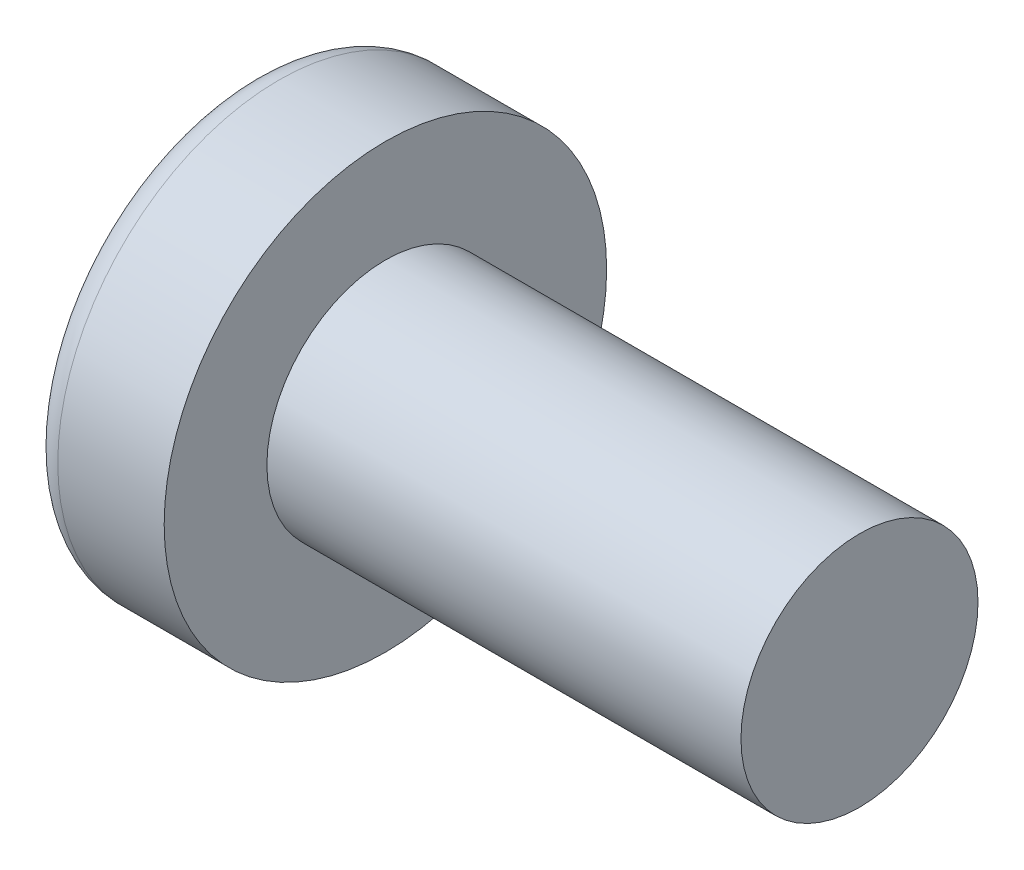
ISO-10303-21;
HEADER;
FILE_DESCRIPTION(('STEP AP214'),'2;1');
FILE_NAME('part.step','',(''),(''),'','','');
FILE_SCHEMA(('AUTOMOTIVE_DESIGN { 1 0 10303 214 1 1 1 1 }'));
ENDSEC;
DATA;
#1=APPLICATION_CONTEXT('core data for automotive mechanical design processes');
#2=APPLICATION_PROTOCOL_DEFINITION('international standard','automotive_design',2000,#1);
#3=PRODUCT_CONTEXT('',#1,'mechanical');
#4=PRODUCT('Part','Part','',(#3));
#5=PRODUCT_RELATED_PRODUCT_CATEGORY('part','',(#4));
#6=PRODUCT_DEFINITION_FORMATION('','',#4);
#7=PRODUCT_DEFINITION_CONTEXT('part definition',#1,'design');
#8=PRODUCT_DEFINITION('design','',#6,#7);
#9=PRODUCT_DEFINITION_SHAPE('','',#8);
#10=(LENGTH_UNIT() NAMED_UNIT(*) SI_UNIT(.MILLI.,.METRE.));
#11=(NAMED_UNIT(*) PLANE_ANGLE_UNIT() SI_UNIT($,.RADIAN.));
#12=(NAMED_UNIT(*) SI_UNIT($,.STERADIAN.) SOLID_ANGLE_UNIT());
#13=UNCERTAINTY_MEASURE_WITH_UNIT(LENGTH_MEASURE(1.E-05),#10,'distance_accuracy_value','');
#14=(GEOMETRIC_REPRESENTATION_CONTEXT(3) GLOBAL_UNCERTAINTY_ASSIGNED_CONTEXT((#13)) GLOBAL_UNIT_ASSIGNED_CONTEXT((#10,
#11,#12)) REPRESENTATION_CONTEXT('',''));
#15=CARTESIAN_POINT('',(0.,0.,0.));
#16=DIRECTION('',(0.,0.,1.));
#17=DIRECTION('',(1.,0.,0.));
#18=AXIS2_PLACEMENT_3D('',#15,#16,#17);
#19=CARTESIAN_POINT('',(5.,0.,0.));
#20=DIRECTION('',(-1.,0.,0.));
#21=DIRECTION('',(0.,1.,0.));
#22=AXIS2_PLACEMENT_3D('',#19,#20,#21);
#23=SPHERICAL_SURFACE('',#22,5.);
#24=CARTESIAN_POINT('',(0.747150706810473,0.,0.));
#25=DIRECTION('',(-1.,0.,0.));
#26=DIRECTION('',(0.,0.,1.));
#27=AXIS2_PLACEMENT_3D('',#24,#25,#26);
#28=CIRCLE('',#27,2.62931034482759);
#29=CARTESIAN_POINT('',(0.747150706810473,0.,2.62931034482759));
#30=VERTEX_POINT('',#29);
#31=EDGE_CURVE('E153',#30,#30,#28,.T.);
#32=ORIENTED_EDGE('',*,*,#31,.T.);
#33=EDGE_LOOP('',(#32));
#34=FACE_BOUND('',#33,.T.);
#35=CARTESIAN_POINT('',(4.98382636322272,-0.153868112043297,0.));
#36=DIRECTION('',(-0.104537710696287,-0.994520923380891,0.));
#37=DIRECTION('',(0.994520923380891,-0.104537710696287,0.));
#38=AXIS2_PLACEMENT_3D('',#35,#36,#37);
#39=CIRCLE('',#38,4.99760572850336);
#40=CARTESIAN_POINT('',(0.188596138461545,0.350175974082163,1.31444652548076));
#41=VERTEX_POINT('',#40);
#42=CARTESIAN_POINT('',(0.0270341343313624,0.367158343834486,0.367158343834487));
#43=VERTEX_POINT('',#42);
#44=EDGE_CURVE('E184',#41,#43,#39,.T.);
#45=ORIENTED_EDGE('',*,*,#44,.F.);
#46=CARTESIAN_POINT('',(3.98403090792016,0.,-1.41352221506761));
#47=DIRECTION('',(0.583636048152575,0.,0.812015371342713));
#48=DIRECTION('',(0.812015371342714,0.,-0.583636048152575));
#49=AXIS2_PLACEMENT_3D('',#46,#47,#48);
#50=CIRCLE('',#49,4.68719124331927);
#51=CARTESIAN_POINT('',(0.188596138461545,-0.350175974082172,1.31444652548076));
#52=VERTEX_POINT('',#51);
#53=EDGE_CURVE('E149',#41,#52,#50,.T.);
#54=ORIENTED_EDGE('',*,*,#53,.T.);
#55=CARTESIAN_POINT('',(4.98382636322272,0.153868112043297,0.));
#56=DIRECTION('',(-0.104537710696287,0.994520923380891,0.));
#57=DIRECTION('',(-0.994520923380891,-0.104537710696287,0.));
#58=AXIS2_PLACEMENT_3D('',#55,#56,#57);
#59=CIRCLE('',#58,4.99760572850336);
#60=CARTESIAN_POINT('',(0.0270341343313616,-0.367158343834489,0.367158343834487));
#61=VERTEX_POINT('',#60);
#62=EDGE_CURVE('E105',#61,#52,#59,.T.);
#63=ORIENTED_EDGE('',*,*,#62,.F.);
#64=CARTESIAN_POINT('',(4.98382636322272,0.,-0.153868112043297));
#65=DIRECTION('',(-0.104537710696287,0.,-0.994520923380891));
#66=DIRECTION('',(-0.994520923380891,0.,0.104537710696287));
#67=AXIS2_PLACEMENT_3D('',#64,#65,#66);
#68=CIRCLE('',#67,4.99760572850336);
#69=CARTESIAN_POINT('',(0.188596138461545,-1.31444652548077,0.350175974082167));
#70=VERTEX_POINT('',#69);
#71=EDGE_CURVE('E130',#70,#61,#68,.T.);
#72=ORIENTED_EDGE('',*,*,#71,.F.);
#73=CARTESIAN_POINT('',(3.98403090792016,1.41352221506761,0.));
#74=DIRECTION('',(0.583636048152575,-0.812015371342713,0.));
#75=DIRECTION('',(0.812015371342714,0.583636048152575,0.));
#76=AXIS2_PLACEMENT_3D('',#73,#74,#75);
#77=CIRCLE('',#76,4.68719124331927);
#78=CARTESIAN_POINT('',(0.188596138461545,-1.31444652548077,-0.350175974082167));
#79=VERTEX_POINT('',#78);
#80=EDGE_CURVE('E138',#70,#79,#77,.T.);
#81=ORIENTED_EDGE('',*,*,#80,.T.);
#82=CARTESIAN_POINT('',(4.98382636322272,0.,0.153868112043297));
#83=DIRECTION('',(-0.104537710696287,0.,0.994520923380891));
#84=DIRECTION('',(0.994520923380891,0.,0.104537710696287));
#85=AXIS2_PLACEMENT_3D('',#82,#83,#84);
#86=CIRCLE('',#85,4.99760572850336);
#87=CARTESIAN_POINT('',(0.0270341343313624,-0.367158343834486,-0.367158343834487));
#88=VERTEX_POINT('',#87);
#89=EDGE_CURVE('E48',#88,#79,#86,.T.);
#90=ORIENTED_EDGE('',*,*,#89,.F.);
#91=CARTESIAN_POINT('',(0.188596138461545,-0.350175974082162,-1.31444652548077));
#92=VERTEX_POINT('',#91);
#93=EDGE_CURVE('E191',#92,#88,#59,.T.);
#94=ORIENTED_EDGE('',*,*,#93,.F.);
#95=CARTESIAN_POINT('',(3.98403090792016,0.,1.41352221506761));
#96=DIRECTION('',(0.583636048152575,0.,-0.812015371342713));
#97=DIRECTION('',(-0.812015371342714,0.,-0.583636048152575));
#98=AXIS2_PLACEMENT_3D('',#95,#96,#97);
#99=CIRCLE('',#98,4.68719124331927);
#100=CARTESIAN_POINT('',(0.188596138461545,0.350175974082172,-1.31444652548076));
#101=VERTEX_POINT('',#100);
#102=EDGE_CURVE('E131',#92,#101,#99,.T.);
#103=ORIENTED_EDGE('',*,*,#102,.T.);
#104=CARTESIAN_POINT('',(0.0270341343313616,0.367158343834489,-0.367158343834487));
#105=VERTEX_POINT('',#104);
#106=EDGE_CURVE('E179',#105,#101,#39,.T.);
#107=ORIENTED_EDGE('',*,*,#106,.F.);
#108=CARTESIAN_POINT('',(0.188596138461545,1.31444652548076,-0.350175974082167));
#109=VERTEX_POINT('',#108);
#110=EDGE_CURVE('E41',#109,#105,#86,.T.);
#111=ORIENTED_EDGE('',*,*,#110,.F.);
#112=CARTESIAN_POINT('',(3.98403090792016,-1.41352221506761,0.));
#113=DIRECTION('',(0.583636048152575,0.812015371342713,0.));
#114=DIRECTION('',(-0.812015371342714,0.583636048152575,0.));
#115=AXIS2_PLACEMENT_3D('',#112,#113,#114);
#116=CIRCLE('',#115,4.68719124331927);
#117=CARTESIAN_POINT('',(0.188596138461545,1.31444652548076,0.350175974082167));
#118=VERTEX_POINT('',#117);
#119=EDGE_CURVE('E11',#109,#118,#116,.T.);
#120=ORIENTED_EDGE('',*,*,#119,.T.);
#121=EDGE_CURVE('E167',#43,#118,#68,.T.);
#122=ORIENTED_EDGE('',*,*,#121,.F.);
#123=EDGE_LOOP('',(#45,#54,#63,#72,#81,#90,#94,#103,#107,#111,#120,#122));
#124=FACE_BOUND('',#123,.T.);
#125=ADVANCED_FACE('F33',(#34,#124),#23,.T.);
#126=CARTESIAN_POINT('',(2.01739130434783,0.,-0.15794466403162));
#127=DIRECTION('',(-0.104537710696287,0.,0.994520923380891));
#128=DIRECTION('',(0.994520923380891,0.,0.104537710696287));
#129=AXIS2_PLACEMENT_3D('',#126,#127,#128);
#130=PLANE('',#129);
#131=ORIENTED_EDGE('',*,*,#110,.T.);
#132=DIRECTION('',(0.989130931836555,-0.103971149085093,0.103971149085092));
#133=VECTOR('',#132,1.);
#134=CARTESIAN_POINT('',(2.03363450411053,0.156237282238383,-0.156237282238382));
#135=LINE('',#134,#133);
#136=CARTESIAN_POINT('',(1.76,0.185000000000001,-0.184999999999999));
#137=VERTEX_POINT('',#136);
#138=EDGE_CURVE('E173',#105,#137,#135,.T.);
#139=ORIENTED_EDGE('',*,*,#138,.T.);
#140=DIRECTION('',(0.80907355338853,-0.581521616498006,0.0850446632823171));
#141=VECTOR('',#140,1.);
#142=CARTESIAN_POINT('',(0.,1.45,-0.37));
#143=LINE('',#142,#141);
#144=EDGE_CURVE('E154',#109,#137,#143,.T.);
#145=ORIENTED_EDGE('',*,*,#144,.F.);
#146=EDGE_LOOP('',(#131,#139,#145));
#147=FACE_BOUND('',#146,.T.);
#148=ADVANCED_FACE('F172',(#147),#130,.T.);
#149=DIRECTION('',(0.80907355338853,0.581521616498006,0.0850446632823171));
#150=VECTOR('',#149,1.);
#151=CARTESIAN_POINT('',(0.,-1.45,-0.37));
#152=LINE('',#151,#150);
#153=CARTESIAN_POINT('',(1.76,-0.185,-0.185));
#154=VERTEX_POINT('',#153);
#155=EDGE_CURVE('E139',#79,#154,#152,.T.);
#156=ORIENTED_EDGE('',*,*,#155,.T.);
#157=DIRECTION('',(-0.989130931836555,-0.103971149085092,-0.103971149085092));
#158=VECTOR('',#157,1.);
#159=CARTESIAN_POINT('',(2.03363450411053,-0.156237282238382,-0.156237282238382));
#160=LINE('',#159,#158);
#161=EDGE_CURVE('E194',#154,#88,#160,.T.);
#162=ORIENTED_EDGE('',*,*,#161,.T.);
#163=ORIENTED_EDGE('',*,*,#89,.T.);
#164=EDGE_LOOP('',(#156,#162,#163));
#165=FACE_BOUND('',#164,.T.);
#166=ADVANCED_FACE('F209',(#165),#130,.T.);
#167=CARTESIAN_POINT('',(2.01739130434783,0.,0.15794466403162));
#168=DIRECTION('',(-0.104537710696287,0.,-0.994520923380891));
#169=DIRECTION('',(-0.994520923380891,0.,0.104537710696287));
#170=AXIS2_PLACEMENT_3D('',#167,#168,#169);
#171=PLANE('',#170);
#172=DIRECTION('',(0.80907355338853,-0.581521616498006,-0.0850446632823171));
#173=VECTOR('',#172,1.);
#174=CARTESIAN_POINT('',(0.,1.45,0.37));
#175=LINE('',#174,#173);
#176=CARTESIAN_POINT('',(1.76,0.185,0.185));
#177=VERTEX_POINT('',#176);
#178=EDGE_CURVE('E210',#118,#177,#175,.T.);
#179=ORIENTED_EDGE('',*,*,#178,.T.);
#180=DIRECTION('',(-0.989130931836555,0.103971149085092,0.103971149085092));
#181=VECTOR('',#180,1.);
#182=CARTESIAN_POINT('',(2.03363450411053,0.156237282238382,0.156237282238382));
#183=LINE('',#182,#181);
#184=EDGE_CURVE('E188',#177,#43,#183,.T.);
#185=ORIENTED_EDGE('',*,*,#184,.T.);
#186=ORIENTED_EDGE('',*,*,#121,.T.);
#187=EDGE_LOOP('',(#179,#185,#186));
#188=FACE_BOUND('',#187,.T.);
#189=ADVANCED_FACE('F214',(#188),#171,.T.);
#190=ORIENTED_EDGE('',*,*,#71,.T.);
#191=DIRECTION('',(0.989130931836555,0.103971149085093,-0.103971149085092));
#192=VECTOR('',#191,1.);
#193=CARTESIAN_POINT('',(2.03363450411053,-0.156237282238383,0.156237282238382));
#194=LINE('',#193,#192);
#195=CARTESIAN_POINT('',(1.76,-0.185000000000001,0.184999999999999));
#196=VERTEX_POINT('',#195);
#197=EDGE_CURVE('E103',#61,#196,#194,.T.);
#198=ORIENTED_EDGE('',*,*,#197,.T.);
#199=DIRECTION('',(0.80907355338853,0.581521616498006,-0.085044663282317));
#200=VECTOR('',#199,1.);
#201=CARTESIAN_POINT('',(0.,-1.45,0.37));
#202=LINE('',#201,#200);
#203=EDGE_CURVE('E128',#70,#196,#202,.T.);
#204=ORIENTED_EDGE('',*,*,#203,.F.);
#205=EDGE_LOOP('',(#190,#198,#204));
#206=FACE_BOUND('',#205,.T.);
#207=ADVANCED_FACE('F127',(#206),#171,.T.);
#208=CARTESIAN_POINT('',(-25.4,0.,0.));
#209=DIRECTION('',(-1.,0.,0.));
#210=DIRECTION('',(0.,0.,1.));
#211=AXIS2_PLACEMENT_3D('',#208,#209,#210);
#212=CYLINDRICAL_SURFACE('',#211,1.5);
#213=CARTESIAN_POINT('',(8.4,0.,0.));
#214=DIRECTION('',(-1.,0.,0.));
#215=DIRECTION('',(0.,0.,1.));
#216=AXIS2_PLACEMENT_3D('',#213,#214,#215);
#217=CIRCLE('',#216,1.5);
#218=CARTESIAN_POINT('',(8.4,0.,1.5));
#219=VERTEX_POINT('',#218);
#220=EDGE_CURVE('E150',#219,#219,#217,.T.);
#221=ORIENTED_EDGE('',*,*,#220,.T.);
#222=EDGE_LOOP('',(#221));
#223=FACE_BOUND('',#222,.T.);
#224=CARTESIAN_POINT('',(2.4,0.,0.));
#225=DIRECTION('',(-1.,0.,0.));
#226=DIRECTION('',(0.,0.,1.));
#227=AXIS2_PLACEMENT_3D('',#224,#225,#226);
#228=CIRCLE('',#227,1.5);
#229=CARTESIAN_POINT('',(2.4,0.,1.5));
#230=VERTEX_POINT('',#229);
#231=EDGE_CURVE('E163',#230,#230,#228,.T.);
#232=ORIENTED_EDGE('',*,*,#231,.F.);
#233=EDGE_LOOP('',(#232));
#234=FACE_BOUND('',#233,.T.);
#235=ADVANCED_FACE('F35',(#223,#234),#212,.T.);
#236=CARTESIAN_POINT('',(2.4,1.5,0.));
#237=DIRECTION('',(-1.,0.,0.));
#238=DIRECTION('',(0.,0.,1.));
#239=AXIS2_PLACEMENT_3D('',#236,#237,#238);
#240=PLANE('',#239);
#241=CARTESIAN_POINT('',(2.4,0.,0.));
#242=DIRECTION('',(-1.,0.,0.));
#243=DIRECTION('',(0.,0.,1.));
#244=AXIS2_PLACEMENT_3D('',#241,#242,#243);
#245=CIRCLE('',#244,2.8);
#246=CARTESIAN_POINT('',(2.4,0.,2.8));
#247=VERTEX_POINT('',#246);
#248=EDGE_CURVE('E160',#247,#247,#245,.T.);
#249=ORIENTED_EDGE('',*,*,#248,.F.);
#250=EDGE_LOOP('',(#249));
#251=FACE_BOUND('',#250,.T.);
#252=ORIENTED_EDGE('',*,*,#231,.T.);
#253=EDGE_LOOP('',(#252));
#254=FACE_BOUND('',#253,.T.);
#255=ADVANCED_FACE('F242',(#251,#254),#240,.F.);
#256=CARTESIAN_POINT('',(-25.4,0.,0.));
#257=DIRECTION('',(-1.,0.,0.));
#258=DIRECTION('',(0.,0.,1.));
#259=AXIS2_PLACEMENT_3D('',#256,#257,#258);
#260=CYLINDRICAL_SURFACE('',#259,2.8);
#261=ORIENTED_EDGE('',*,*,#248,.T.);
#262=EDGE_LOOP('',(#261));
#263=FACE_BOUND('',#262,.T.);
#264=CARTESIAN_POINT('',(1.05335585592012,0.,0.));
#265=DIRECTION('',(-1.,0.,0.));
#266=DIRECTION('',(0.,0.,1.));
#267=AXIS2_PLACEMENT_3D('',#264,#265,#266);
#268=CIRCLE('',#267,2.8);
#269=CARTESIAN_POINT('',(1.05335585592012,0.,2.8));
#270=VERTEX_POINT('',#269);
#271=EDGE_CURVE('E157',#270,#270,#268,.T.);
#272=ORIENTED_EDGE('',*,*,#271,.F.);
#273=EDGE_LOOP('',(#272));
#274=FACE_BOUND('',#273,.T.);
#275=ADVANCED_FACE('F239',(#263,#274),#260,.T.);
#276=CARTESIAN_POINT('',(1.05335585592012,0.,0.));
#277=DIRECTION('',(-1.,0.,0.));
#278=DIRECTION('',(0.,0.,1.));
#279=AXIS2_PLACEMENT_3D('',#276,#277,#278);
#280=TOROIDAL_SURFACE('',#279,2.44,0.360000000000001);
#281=ORIENTED_EDGE('',*,*,#271,.T.);
#282=EDGE_LOOP('',(#281));
#283=FACE_BOUND('',#282,.T.);
#284=ORIENTED_EDGE('',*,*,#31,.F.);
#285=EDGE_LOOP('',(#284));
#286=FACE_BOUND('',#285,.T.);
#287=ADVANCED_FACE('F236',(#283,#286),#280,.T.);
#288=CARTESIAN_POINT('',(8.4,1.5,0.));
#289=DIRECTION('',(1.,0.,0.));
#290=DIRECTION('',(0.,0.,-1.));
#291=AXIS2_PLACEMENT_3D('',#288,#289,#290);
#292=PLANE('',#291);
#293=ORIENTED_EDGE('',*,*,#220,.F.);
#294=EDGE_LOOP('',(#293));
#295=FACE_BOUND('',#294,.T.);
#296=ADVANCED_FACE('F234',(#295),#292,.T.);
#297=CARTESIAN_POINT('',(1.76,0.185,0.185));
#298=DIRECTION('',(0.583636048152575,0.812015371342713,0.));
#299=DIRECTION('',(-0.812015371342714,0.583636048152575,0.));
#300=AXIS2_PLACEMENT_3D('',#297,#298,#299);
#301=PLANE('',#300);
#302=ORIENTED_EDGE('',*,*,#144,.T.);
#303=DIRECTION('',(0.,0.,-1.));
#304=VECTOR('',#303,1.);
#305=CARTESIAN_POINT('',(1.76,0.185,0.185));
#306=LINE('',#305,#304);
#307=EDGE_CURVE('E121',#177,#137,#306,.T.);
#308=ORIENTED_EDGE('',*,*,#307,.F.);
#309=ORIENTED_EDGE('',*,*,#178,.F.);
#310=ORIENTED_EDGE('',*,*,#119,.F.);
#311=EDGE_LOOP('',(#302,#308,#309,#310));
#312=FACE_BOUND('',#311,.T.);
#313=ADVANCED_FACE('F213',(#312),#301,.F.);
#314=CARTESIAN_POINT('',(1.76,-0.185,-0.185));
#315=DIRECTION('',(0.583636048152575,-0.812015371342713,0.));
#316=DIRECTION('',(0.812015371342714,0.583636048152575,0.));
#317=AXIS2_PLACEMENT_3D('',#314,#315,#316);
#318=PLANE('',#317);
#319=ORIENTED_EDGE('',*,*,#203,.T.);
#320=DIRECTION('',(0.,0.,1.));
#321=VECTOR('',#320,1.);
#322=CARTESIAN_POINT('',(1.76,-0.185,-0.185));
#323=LINE('',#322,#321);
#324=EDGE_CURVE('E120',#154,#196,#323,.T.);
#325=ORIENTED_EDGE('',*,*,#324,.F.);
#326=ORIENTED_EDGE('',*,*,#155,.F.);
#327=ORIENTED_EDGE('',*,*,#80,.F.);
#328=EDGE_LOOP('',(#319,#325,#326,#327));
#329=FACE_BOUND('',#328,.T.);
#330=ADVANCED_FACE('F135',(#329),#318,.F.);
#331=CARTESIAN_POINT('',(1.76,0.185,-0.185));
#332=DIRECTION('',(-1.,0.,0.));
#333=DIRECTION('',(0.,0.,1.));
#334=AXIS2_PLACEMENT_3D('',#331,#332,#333);
#335=PLANE('',#334);
#336=DIRECTION('',(0.,1.,0.));
#337=VECTOR('',#336,1.);
#338=CARTESIAN_POINT('',(1.76,-0.185,-0.185));
#339=LINE('',#338,#337);
#340=EDGE_CURVE('E143',#154,#137,#339,.T.);
#341=ORIENTED_EDGE('',*,*,#340,.F.);
#342=ORIENTED_EDGE('',*,*,#324,.T.);
#343=DIRECTION('',(0.,-1.,0.));
#344=VECTOR('',#343,1.);
#345=CARTESIAN_POINT('',(1.76,0.185,0.185));
#346=LINE('',#345,#344);
#347=EDGE_CURVE('E112',#177,#196,#346,.T.);
#348=ORIENTED_EDGE('',*,*,#347,.F.);
#349=ORIENTED_EDGE('',*,*,#307,.T.);
#350=EDGE_LOOP('',(#341,#342,#348,#349));
#351=FACE_BOUND('',#350,.T.);
#352=ADVANCED_FACE('F141',(#351),#335,.T.);
#353=CARTESIAN_POINT('',(1.76,0.185000000000001,-0.184999999999999));
#354=DIRECTION('',(0.583636048152575,0.,-0.812015371342713));
#355=DIRECTION('',(0.812015371342714,0.,0.583636048152575));
#356=AXIS2_PLACEMENT_3D('',#353,#354,#355);
#357=PLANE('',#356);
#358=DIRECTION('',(0.80907355338853,0.085044663282315,0.581521616498006));
#359=VECTOR('',#358,1.);
#360=CARTESIAN_POINT('',(0.,-0.369999999999995,-1.45));
#361=LINE('',#360,#359);
#362=EDGE_CURVE('E199',#92,#154,#361,.T.);
#363=ORIENTED_EDGE('',*,*,#362,.T.);
#364=ORIENTED_EDGE('',*,*,#340,.T.);
#365=DIRECTION('',(0.80907355338853,-0.0850446632823191,0.581521616498006));
#366=VECTOR('',#365,1.);
#367=CARTESIAN_POINT('',(0.,0.370000000000005,-1.45));
#368=LINE('',#367,#366);
#369=EDGE_CURVE('E109',#101,#137,#368,.T.);
#370=ORIENTED_EDGE('',*,*,#369,.F.);
#371=ORIENTED_EDGE('',*,*,#102,.F.);
#372=EDGE_LOOP('',(#363,#364,#370,#371));
#373=FACE_BOUND('',#372,.T.);
#374=ADVANCED_FACE('F204',(#373),#357,.F.);
#375=CARTESIAN_POINT('',(2.01739130434783,-0.15794466403162,0.));
#376=DIRECTION('',(-0.104537710696287,0.994520923380891,0.));
#377=DIRECTION('',(-0.994520923380891,-0.104537710696287,0.));
#378=AXIS2_PLACEMENT_3D('',#375,#376,#377);
#379=PLANE('',#378);
#380=ORIENTED_EDGE('',*,*,#93,.T.);
#381=ORIENTED_EDGE('',*,*,#161,.F.);
#382=ORIENTED_EDGE('',*,*,#362,.F.);
#383=EDGE_LOOP('',(#380,#381,#382));
#384=FACE_BOUND('',#383,.T.);
#385=ADVANCED_FACE('F208',(#384),#379,.T.);
#386=CARTESIAN_POINT('',(2.01739130434783,0.15794466403162,0.));
#387=DIRECTION('',(-0.104537710696287,-0.994520923380891,0.));
#388=DIRECTION('',(0.994520923380891,-0.104537710696287,0.));
#389=AXIS2_PLACEMENT_3D('',#386,#387,#388);
#390=PLANE('',#389);
#391=ORIENTED_EDGE('',*,*,#106,.T.);
#392=ORIENTED_EDGE('',*,*,#369,.T.);
#393=ORIENTED_EDGE('',*,*,#138,.F.);
#394=EDGE_LOOP('',(#391,#392,#393));
#395=FACE_BOUND('',#394,.T.);
#396=ADVANCED_FACE('F202',(#395),#390,.T.);
#397=CARTESIAN_POINT('',(1.76,-0.185000000000001,0.184999999999999));
#398=DIRECTION('',(0.583636048152575,0.,0.812015371342713));
#399=DIRECTION('',(-0.812015371342714,0.,0.583636048152575));
#400=AXIS2_PLACEMENT_3D('',#397,#398,#399);
#401=PLANE('',#400);
#402=DIRECTION('',(0.80907355338853,-0.0850446632823151,-0.581521616498006));
#403=VECTOR('',#402,1.);
#404=CARTESIAN_POINT('',(0.,0.369999999999995,1.45));
#405=LINE('',#404,#403);
#406=EDGE_CURVE('E108',#41,#177,#405,.T.);
#407=ORIENTED_EDGE('',*,*,#406,.T.);
#408=ORIENTED_EDGE('',*,*,#347,.T.);
#409=DIRECTION('',(0.80907355338853,0.0850446632823192,-0.581521616498006));
#410=VECTOR('',#409,1.);
#411=CARTESIAN_POINT('',(0.,-0.370000000000005,1.45));
#412=LINE('',#411,#410);
#413=EDGE_CURVE('E99',#52,#196,#412,.T.);
#414=ORIENTED_EDGE('',*,*,#413,.F.);
#415=ORIENTED_EDGE('',*,*,#53,.F.);
#416=EDGE_LOOP('',(#407,#408,#414,#415));
#417=FACE_BOUND('',#416,.T.);
#418=ADVANCED_FACE('F113',(#417),#401,.F.);
#419=ORIENTED_EDGE('',*,*,#44,.T.);
#420=ORIENTED_EDGE('',*,*,#184,.F.);
#421=ORIENTED_EDGE('',*,*,#406,.F.);
#422=EDGE_LOOP('',(#419,#420,#421));
#423=FACE_BOUND('',#422,.T.);
#424=ADVANCED_FACE('F215',(#423),#390,.T.);
#425=ORIENTED_EDGE('',*,*,#62,.T.);
#426=ORIENTED_EDGE('',*,*,#413,.T.);
#427=ORIENTED_EDGE('',*,*,#197,.F.);
#428=EDGE_LOOP('',(#425,#426,#427));
#429=FACE_BOUND('',#428,.T.);
#430=ADVANCED_FACE('F101',(#429),#379,.T.);
#431=CLOSED_SHELL('',(#125,#148,#166,#189,#207,#235,#255,#275,#287,#296,#313,#330,#352,#374,
#385,#396,#418,#424,#430));
#432=MANIFOLD_SOLID_BREP('B2',#431);
#433=ADVANCED_BREP_SHAPE_REPRESENTATION('',(#18,#432),#14);
#434=SHAPE_DEFINITION_REPRESENTATION(#9,#433);
ENDSEC;
END-ISO-10303-21;
